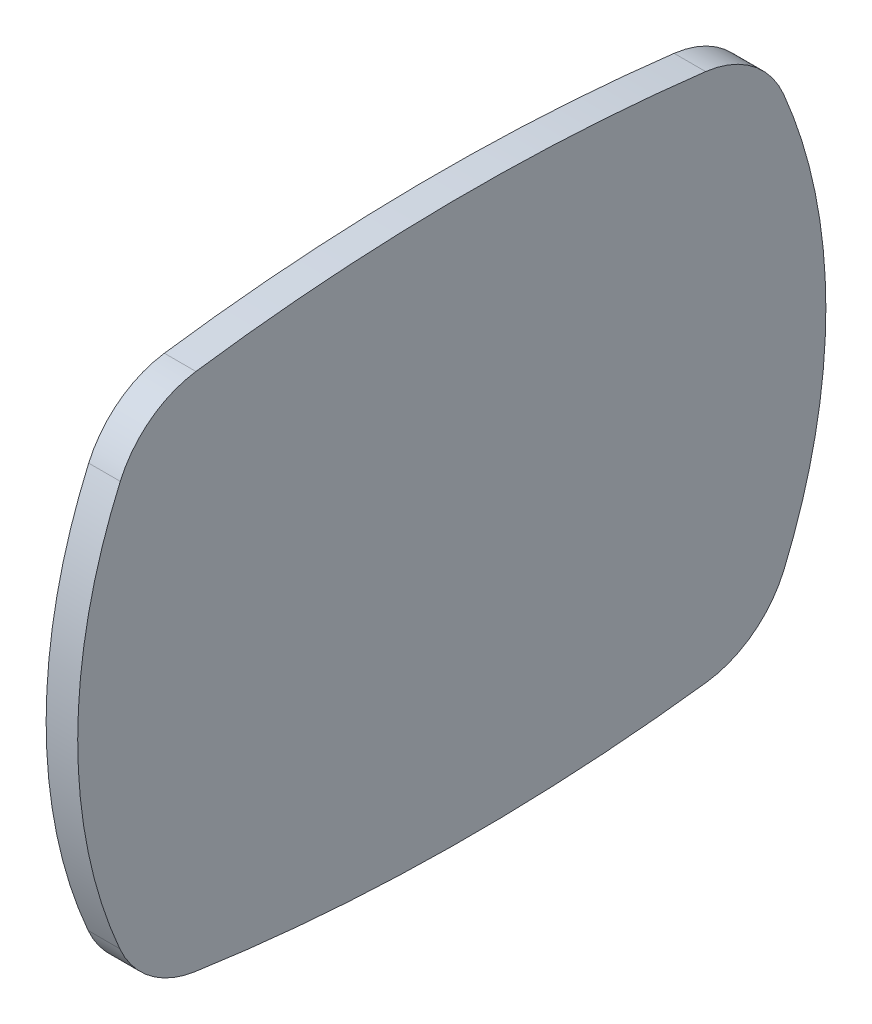
ISO-10303-21;
HEADER;
FILE_DESCRIPTION(('STEP AP214'),'2;1');
FILE_NAME('part.step','',(''),(''),'','','');
FILE_SCHEMA(('AUTOMOTIVE_DESIGN { 1 0 10303 214 1 1 1 1 }'));
ENDSEC;
DATA;
#1=APPLICATION_CONTEXT('core data for automotive mechanical design processes');
#2=APPLICATION_PROTOCOL_DEFINITION('international standard','automotive_design',2000,#1);
#3=PRODUCT_CONTEXT('',#1,'mechanical');
#4=PRODUCT('Part','Part','',(#3));
#5=PRODUCT_RELATED_PRODUCT_CATEGORY('part','',(#4));
#6=PRODUCT_DEFINITION_FORMATION('','',#4);
#7=PRODUCT_DEFINITION_CONTEXT('part definition',#1,'design');
#8=PRODUCT_DEFINITION('design','',#6,#7);
#9=PRODUCT_DEFINITION_SHAPE('','',#8);
#10=(LENGTH_UNIT() NAMED_UNIT(*) SI_UNIT(.MILLI.,.METRE.));
#11=(NAMED_UNIT(*) PLANE_ANGLE_UNIT() SI_UNIT($,.RADIAN.));
#12=(NAMED_UNIT(*) SI_UNIT($,.STERADIAN.) SOLID_ANGLE_UNIT());
#13=UNCERTAINTY_MEASURE_WITH_UNIT(LENGTH_MEASURE(1.E-05),#10,'distance_accuracy_value','');
#14=(GEOMETRIC_REPRESENTATION_CONTEXT(3) GLOBAL_UNCERTAINTY_ASSIGNED_CONTEXT((#13)) GLOBAL_UNIT_ASSIGNED_CONTEXT((#10,
#11,#12)) REPRESENTATION_CONTEXT('',''));
#15=CARTESIAN_POINT('',(0.,0.,0.));
#16=DIRECTION('',(0.,0.,1.));
#17=DIRECTION('',(1.,0.,0.));
#18=AXIS2_PLACEMENT_3D('',#15,#16,#17);
#19=CARTESIAN_POINT('',(-49.5727921140195,-212.523644842331,-6.70556409455175));
#20=DIRECTION('',(1.,0.,0.));
#21=DIRECTION('',(0.,0.,-1.));
#22=AXIS2_PLACEMENT_3D('',#19,#20,#21);
#23=PLANE('',#22);
#24=CARTESIAN_POINT('',(-49.5727921140195,-216.835110358848,1.14460312668996));
#25=DIRECTION('',(1.,0.,0.));
#26=DIRECTION('',(0.,0.,-1.));
#27=AXIS2_PLACEMENT_3D('',#24,#25,#26);
#28=CIRCLE('',#27,2.50000000000337);
#29=CARTESIAN_POINT('',(-49.5727921140195,-217.814012636218,-1.15577734866083));
#30=VERTEX_POINT('',#29);
#31=CARTESIAN_POINT('',(-49.5727921140191,-219.315412286959,0.831390187262833));
#32=VERTEX_POINT('',#31);
#33=EDGE_CURVE('E88',#30,#32,#28,.F.);
#34=ORIENTED_EDGE('',*,*,#33,.F.);
#35=CARTESIAN_POINT('',(-49.5727921140195,-212.533748229675,11.2526289103765));
#36=DIRECTION('',(1.,0.,0.));
#37=DIRECTION('',(0.,0.,-1.));
#38=AXIS2_PLACEMENT_3D('',#35,#36,#37);
#39=CIRCLE('',#38,13.4851673364597);
#40=CARTESIAN_POINT('',(-49.5727921140195,-207.232574048342,-1.14685859481851));
#41=VERTEX_POINT('',#40);
#42=EDGE_CURVE('E84',#41,#30,#39,.F.);
#43=ORIENTED_EDGE('',*,*,#42,.F.);
#44=CARTESIAN_POINT('',(-49.5727921140195,-208.215352765334,1.15186844278843));
#45=DIRECTION('',(1.,0.,0.));
#46=DIRECTION('',(0.,0.,-1.));
#47=AXIS2_PLACEMENT_3D('',#44,#45,#46);
#48=CIRCLE('',#47,2.49999999999961);
#49=CARTESIAN_POINT('',(-49.5727921140195,-205.733450319357,0.851601480488759));
#50=VERTEX_POINT('',#49);
#51=EDGE_CURVE('E20',#50,#41,#48,.F.);
#52=ORIENTED_EDGE('',*,*,#51,.F.);
#53=CARTESIAN_POINT('',(-49.5727921140196,-255.848637831579,6.91466618461294));
#54=DIRECTION('',(1.,0.,0.));
#55=DIRECTION('',(0.,0.,-1.));
#56=AXIS2_PLACEMENT_3D('',#53,#54,#55);
#57=CIRCLE('',#56,50.480617795264);
#58=CARTESIAN_POINT('',(-49.5727921140196,-205.858024347971,13.9311707648239));
#59=VERTEX_POINT('',#58);
#60=EDGE_CURVE('E79',#59,#50,#57,.F.);
#61=ORIENTED_EDGE('',*,*,#60,.F.);
#62=CARTESIAN_POINT('',(-49.5727921140196,-208.333757394973,13.5836856860627));
#63=DIRECTION('',(1.,0.,0.));
#64=DIRECTION('',(0.,0.,-1.));
#65=AXIS2_PLACEMENT_3D('',#62,#63,#64);
#66=CIRCLE('',#65,2.49999999999587);
#67=CARTESIAN_POINT('',(-49.5727921140196,-207.329099232493,15.8729349028456));
#68=VERTEX_POINT('',#67);
#69=EDGE_CURVE('E132',#68,#59,#66,.F.);
#70=ORIENTED_EDGE('',*,*,#69,.F.);
#71=CARTESIAN_POINT('',(-49.5727921140196,-212.533923101592,4.01304124866189));
#72=DIRECTION('',(1.,0.,0.));
#73=DIRECTION('',(0.,0.,-1.));
#74=AXIS2_PLACEMENT_3D('',#71,#72,#73);
#75=CIRCLE('',#74,12.9517284173539);
#76=CARTESIAN_POINT('',(-49.5727921140196,-217.709473918627,15.8857386143487));
#77=VERTEX_POINT('',#76);
#78=EDGE_CURVE('E129',#77,#68,#75,.F.);
#79=ORIENTED_EDGE('',*,*,#78,.F.);
#80=CARTESIAN_POINT('',(-49.5727921140196,-216.710466170346,13.5940179684469));
#81=DIRECTION('',(1.,0.,0.));
#82=DIRECTION('',(0.,0.,-1.));
#83=AXIS2_PLACEMENT_3D('',#80,#81,#82);
#84=CIRCLE('',#83,2.49999999999553);
#85=CARTESIAN_POINT('',(-49.5727921140196,-219.183999711653,13.9568289660859));
#86=VERTEX_POINT('',#85);
#87=EDGE_CURVE('E127',#86,#77,#84,.F.);
#88=ORIENTED_EDGE('',*,*,#87,.F.);
#89=CARTESIAN_POINT('',(-49.5727921140195,-171.158757876455,6.91262050434193));
#90=DIRECTION('',(1.,0.,0.));
#91=DIRECTION('',(0.,0.,-1.));
#92=AXIS2_PLACEMENT_3D('',#89,#90,#91);
#93=CIRCLE('',#92,48.539105123413);
#94=EDGE_CURVE('E123',#32,#86,#93,.F.);
#95=ORIENTED_EDGE('',*,*,#94,.F.);
#96=EDGE_LOOP('',(#34,#43,#52,#61,#70,#79,#88,#95));
#97=FACE_BOUND('',#96,.T.);
#98=ADVANCED_FACE('F17',(#97),#23,.T.);
#99=CARTESIAN_POINT('',(-50.3827921140195,-208.215352765334,1.15186844278843));
#100=DIRECTION('',(1.,0.,0.));
#101=DIRECTION('',(0.,0.,-1.));
#102=AXIS2_PLACEMENT_3D('',#99,#100,#101);
#103=CYLINDRICAL_SURFACE('',#102,2.49999999999961);
#104=CARTESIAN_POINT('',(-50.3827921140194,-208.215352765334,1.15186844278843));
#105=DIRECTION('',(1.,0.,0.));
#106=DIRECTION('',(0.,0.,-1.));
#107=AXIS2_PLACEMENT_3D('',#104,#105,#106);
#108=CIRCLE('',#107,2.49999999999961);
#109=CARTESIAN_POINT('',(-50.3827921140194,-207.232574048342,-1.14685859481852));
#110=VERTEX_POINT('',#109);
#111=CARTESIAN_POINT('',(-50.3827921140195,-205.733450319357,0.851601480488756));
#112=VERTEX_POINT('',#111);
#113=EDGE_CURVE('E118',#110,#112,#108,.T.);
#114=ORIENTED_EDGE('',*,*,#113,.T.);
#115=DIRECTION('',(1.,0.,0.));
#116=VECTOR('',#115,1.);
#117=CARTESIAN_POINT('',(-50.3827921140195,-205.733450319358,0.851601480486821));
#118=LINE('',#117,#116);
#119=EDGE_CURVE('E99',#50,#112,#118,.F.);
#120=ORIENTED_EDGE('',*,*,#119,.F.);
#121=ORIENTED_EDGE('',*,*,#51,.T.);
#122=DIRECTION('',(1.,0.,0.));
#123=VECTOR('',#122,1.);
#124=CARTESIAN_POINT('',(-50.3827921140195,-207.23257404834,-1.14685859481773));
#125=LINE('',#124,#123);
#126=EDGE_CURVE('E98',#41,#110,#125,.F.);
#127=ORIENTED_EDGE('',*,*,#126,.T.);
#128=EDGE_LOOP('',(#114,#120,#121,#127));
#129=FACE_BOUND('',#128,.T.);
#130=ADVANCED_FACE('F97',(#129),#103,.T.);
#131=CARTESIAN_POINT('',(-50.3827921140195,-255.848637831579,6.91466618461294));
#132=DIRECTION('',(1.,0.,0.));
#133=DIRECTION('',(0.,0.,-1.));
#134=AXIS2_PLACEMENT_3D('',#131,#132,#133);
#135=CYLINDRICAL_SURFACE('',#134,50.480617795264);
#136=CARTESIAN_POINT('',(-50.3827921140195,-255.848637831579,6.91466618461294));
#137=DIRECTION('',(1.,0.,0.));
#138=DIRECTION('',(0.,0.,-1.));
#139=AXIS2_PLACEMENT_3D('',#136,#137,#138);
#140=CIRCLE('',#139,50.480617795264);
#141=CARTESIAN_POINT('',(-50.3827921140196,-205.858024347971,13.9311707648239));
#142=VERTEX_POINT('',#141);
#143=EDGE_CURVE('E115',#112,#142,#140,.T.);
#144=ORIENTED_EDGE('',*,*,#143,.T.);
#145=DIRECTION('',(1.,0.,0.));
#146=VECTOR('',#145,1.);
#147=CARTESIAN_POINT('',(-50.3827921140195,-205.858024347971,13.9311707648239));
#148=LINE('',#147,#146);
#149=EDGE_CURVE('E133',#59,#142,#148,.F.);
#150=ORIENTED_EDGE('',*,*,#149,.F.);
#151=ORIENTED_EDGE('',*,*,#60,.T.);
#152=ORIENTED_EDGE('',*,*,#119,.T.);
#153=EDGE_LOOP('',(#144,#150,#151,#152));
#154=FACE_BOUND('',#153,.T.);
#155=ADVANCED_FACE('F138',(#154),#135,.T.);
#156=CARTESIAN_POINT('',(-50.3827921140195,-208.333757394973,13.5836856860627));
#157=DIRECTION('',(1.,0.,0.));
#158=DIRECTION('',(0.,0.,-1.));
#159=AXIS2_PLACEMENT_3D('',#156,#157,#158);
#160=CYLINDRICAL_SURFACE('',#159,2.49999999999587);
#161=CARTESIAN_POINT('',(-50.3827921140196,-208.333757394973,13.5836856860627));
#162=DIRECTION('',(1.,0.,0.));
#163=DIRECTION('',(0.,0.,-1.));
#164=AXIS2_PLACEMENT_3D('',#161,#162,#163);
#165=CIRCLE('',#164,2.49999999999587);
#166=CARTESIAN_POINT('',(-50.3827921140196,-207.329099232493,15.8729349028455));
#167=VERTEX_POINT('',#166);
#168=EDGE_CURVE('E112',#142,#167,#165,.T.);
#169=ORIENTED_EDGE('',*,*,#168,.T.);
#170=DIRECTION('',(1.,0.,0.));
#171=VECTOR('',#170,1.);
#172=CARTESIAN_POINT('',(-50.3827921140194,-207.329099232493,15.8729349028457));
#173=LINE('',#172,#171);
#174=EDGE_CURVE('E131',#68,#167,#173,.F.);
#175=ORIENTED_EDGE('',*,*,#174,.F.);
#176=ORIENTED_EDGE('',*,*,#69,.T.);
#177=ORIENTED_EDGE('',*,*,#149,.T.);
#178=EDGE_LOOP('',(#169,#175,#176,#177));
#179=FACE_BOUND('',#178,.T.);
#180=ADVANCED_FACE('F143',(#179),#160,.T.);
#181=CARTESIAN_POINT('',(-50.3827921140194,-212.533923101592,4.01304124866189));
#182=DIRECTION('',(1.,0.,0.));
#183=DIRECTION('',(0.,0.,-1.));
#184=AXIS2_PLACEMENT_3D('',#181,#182,#183);
#185=CYLINDRICAL_SURFACE('',#184,12.9517284173539);
#186=DIRECTION('',(1.,0.,0.));
#187=VECTOR('',#186,1.);
#188=CARTESIAN_POINT('',(-50.3827921140195,-217.709473918627,15.8857386143486));
#189=LINE('',#188,#187);
#190=CARTESIAN_POINT('',(-50.3827921140196,-217.709473918627,15.8857386143487));
#191=VERTEX_POINT('',#190);
#192=EDGE_CURVE('E126',#77,#191,#189,.F.);
#193=ORIENTED_EDGE('',*,*,#192,.F.);
#194=ORIENTED_EDGE('',*,*,#78,.T.);
#195=ORIENTED_EDGE('',*,*,#174,.T.);
#196=CARTESIAN_POINT('',(-50.3827921140196,-212.533923101592,4.01304124866189));
#197=DIRECTION('',(1.,0.,0.));
#198=DIRECTION('',(0.,0.,-1.));
#199=AXIS2_PLACEMENT_3D('',#196,#197,#198);
#200=CIRCLE('',#199,12.9517284173539);
#201=EDGE_CURVE('E110',#167,#191,#200,.T.);
#202=ORIENTED_EDGE('',*,*,#201,.T.);
#203=EDGE_LOOP('',(#193,#194,#195,#202));
#204=FACE_BOUND('',#203,.T.);
#205=ADVANCED_FACE('F163',(#204),#185,.T.);
#206=CARTESIAN_POINT('',(-50.3827921140195,-216.710466170346,13.5940179684469));
#207=DIRECTION('',(1.,0.,0.));
#208=DIRECTION('',(0.,0.,-1.));
#209=AXIS2_PLACEMENT_3D('',#206,#207,#208);
#210=CYLINDRICAL_SURFACE('',#209,2.49999999999553);
#211=CARTESIAN_POINT('',(-50.3827921140196,-216.710466170346,13.5940179684469));
#212=DIRECTION('',(1.,0.,0.));
#213=DIRECTION('',(0.,0.,-1.));
#214=AXIS2_PLACEMENT_3D('',#211,#212,#213);
#215=CIRCLE('',#214,2.49999999999553);
#216=CARTESIAN_POINT('',(-50.3827921140196,-219.183999711653,13.9568289660859));
#217=VERTEX_POINT('',#216);
#218=EDGE_CURVE('E107',#191,#217,#215,.T.);
#219=ORIENTED_EDGE('',*,*,#218,.T.);
#220=DIRECTION('',(1.,0.,0.));
#221=VECTOR('',#220,1.);
#222=CARTESIAN_POINT('',(-50.3827921140195,-219.183999711653,13.9568289660859));
#223=LINE('',#222,#221);
#224=EDGE_CURVE('E125',#86,#217,#223,.F.);
#225=ORIENTED_EDGE('',*,*,#224,.F.);
#226=ORIENTED_EDGE('',*,*,#87,.T.);
#227=ORIENTED_EDGE('',*,*,#192,.T.);
#228=EDGE_LOOP('',(#219,#225,#226,#227));
#229=FACE_BOUND('',#228,.T.);
#230=ADVANCED_FACE('F160',(#229),#210,.T.);
#231=CARTESIAN_POINT('',(-50.3827921140195,-171.158757876455,6.91262050434193));
#232=DIRECTION('',(1.,0.,0.));
#233=DIRECTION('',(0.,0.,-1.));
#234=AXIS2_PLACEMENT_3D('',#231,#232,#233);
#235=CYLINDRICAL_SURFACE('',#234,48.539105123413);
#236=CARTESIAN_POINT('',(-50.3827921140196,-171.158757876455,6.91262050434193));
#237=DIRECTION('',(1.,0.,0.));
#238=DIRECTION('',(0.,0.,-1.));
#239=AXIS2_PLACEMENT_3D('',#236,#237,#238);
#240=CIRCLE('',#239,48.539105123413);
#241=CARTESIAN_POINT('',(-50.3827921140195,-219.315412286959,0.83139018726283));
#242=VERTEX_POINT('',#241);
#243=EDGE_CURVE('E26',#217,#242,#240,.T.);
#244=ORIENTED_EDGE('',*,*,#243,.T.);
#245=DIRECTION('',(1.,0.,0.));
#246=VECTOR('',#245,1.);
#247=CARTESIAN_POINT('',(-50.3827921140154,-219.315412286959,0.831390187259582));
#248=LINE('',#247,#246);
#249=EDGE_CURVE('E122',#32,#242,#248,.F.);
#250=ORIENTED_EDGE('',*,*,#249,.F.);
#251=ORIENTED_EDGE('',*,*,#94,.T.);
#252=ORIENTED_EDGE('',*,*,#224,.T.);
#253=EDGE_LOOP('',(#244,#250,#251,#252));
#254=FACE_BOUND('',#253,.T.);
#255=ADVANCED_FACE('F156',(#254),#235,.T.);
#256=CARTESIAN_POINT('',(-50.3827921140154,-216.835110358848,1.14460312668996));
#257=DIRECTION('',(1.,0.,0.));
#258=DIRECTION('',(0.,0.,-1.));
#259=AXIS2_PLACEMENT_3D('',#256,#257,#258);
#260=CYLINDRICAL_SURFACE('',#259,2.50000000000337);
#261=DIRECTION('',(1.,0.,0.));
#262=VECTOR('',#261,1.);
#263=CARTESIAN_POINT('',(-50.3827921140195,-217.814012636218,-1.15577734866081));
#264=LINE('',#263,#262);
#265=CARTESIAN_POINT('',(-50.3827921140191,-217.814012636218,-1.15577734866083));
#266=VERTEX_POINT('',#265);
#267=EDGE_CURVE('E93',#30,#266,#264,.F.);
#268=ORIENTED_EDGE('',*,*,#267,.F.);
#269=ORIENTED_EDGE('',*,*,#33,.T.);
#270=ORIENTED_EDGE('',*,*,#249,.T.);
#271=CARTESIAN_POINT('',(-50.3827921140195,-216.835110358848,1.14460312668996));
#272=DIRECTION('',(1.,0.,0.));
#273=DIRECTION('',(0.,0.,-1.));
#274=AXIS2_PLACEMENT_3D('',#271,#272,#273);
#275=CIRCLE('',#274,2.50000000000337);
#276=EDGE_CURVE('E11',#242,#266,#275,.T.);
#277=ORIENTED_EDGE('',*,*,#276,.T.);
#278=EDGE_LOOP('',(#268,#269,#270,#277));
#279=FACE_BOUND('',#278,.T.);
#280=ADVANCED_FACE('F152',(#279),#260,.T.);
#281=CARTESIAN_POINT('',(-50.3827921140195,-212.533748229675,11.2526289103765));
#282=DIRECTION('',(1.,0.,0.));
#283=DIRECTION('',(0.,0.,-1.));
#284=AXIS2_PLACEMENT_3D('',#281,#282,#283);
#285=CYLINDRICAL_SURFACE('',#284,13.4851673364597);
#286=ORIENTED_EDGE('',*,*,#267,.T.);
#287=CARTESIAN_POINT('',(-50.3827921140195,-212.533748229675,11.2526289103765));
#288=DIRECTION('',(1.,0.,0.));
#289=DIRECTION('',(0.,0.,-1.));
#290=AXIS2_PLACEMENT_3D('',#287,#288,#289);
#291=CIRCLE('',#290,13.4851673364597);
#292=EDGE_CURVE('E35',#266,#110,#291,.T.);
#293=ORIENTED_EDGE('',*,*,#292,.T.);
#294=ORIENTED_EDGE('',*,*,#126,.F.);
#295=ORIENTED_EDGE('',*,*,#42,.T.);
#296=EDGE_LOOP('',(#286,#293,#294,#295));
#297=FACE_BOUND('',#296,.T.);
#298=ADVANCED_FACE('F100',(#297),#285,.T.);
#299=CARTESIAN_POINT('',(-50.3827921140195,-212.523644842331,-6.70556409455175));
#300=DIRECTION('',(1.,0.,0.));
#301=DIRECTION('',(0.,0.,-1.));
#302=AXIS2_PLACEMENT_3D('',#299,#300,#301);
#303=PLANE('',#302);
#304=ORIENTED_EDGE('',*,*,#292,.F.);
#305=ORIENTED_EDGE('',*,*,#276,.F.);
#306=ORIENTED_EDGE('',*,*,#243,.F.);
#307=ORIENTED_EDGE('',*,*,#218,.F.);
#308=ORIENTED_EDGE('',*,*,#201,.F.);
#309=ORIENTED_EDGE('',*,*,#168,.F.);
#310=ORIENTED_EDGE('',*,*,#143,.F.);
#311=ORIENTED_EDGE('',*,*,#113,.F.);
#312=EDGE_LOOP('',(#304,#305,#306,#307,#308,#309,#310,#311));
#313=FACE_BOUND('',#312,.T.);
#314=ADVANCED_FACE('F140',(#313),#303,.F.);
#315=CLOSED_SHELL('',(#98,#130,#155,#180,#205,#230,#255,#280,#298,#314));
#316=MANIFOLD_SOLID_BREP('B1',#315);
#317=ADVANCED_BREP_SHAPE_REPRESENTATION('',(#18,#316),#14);
#318=SHAPE_DEFINITION_REPRESENTATION(#9,#317);
ENDSEC;
END-ISO-10303-21;
